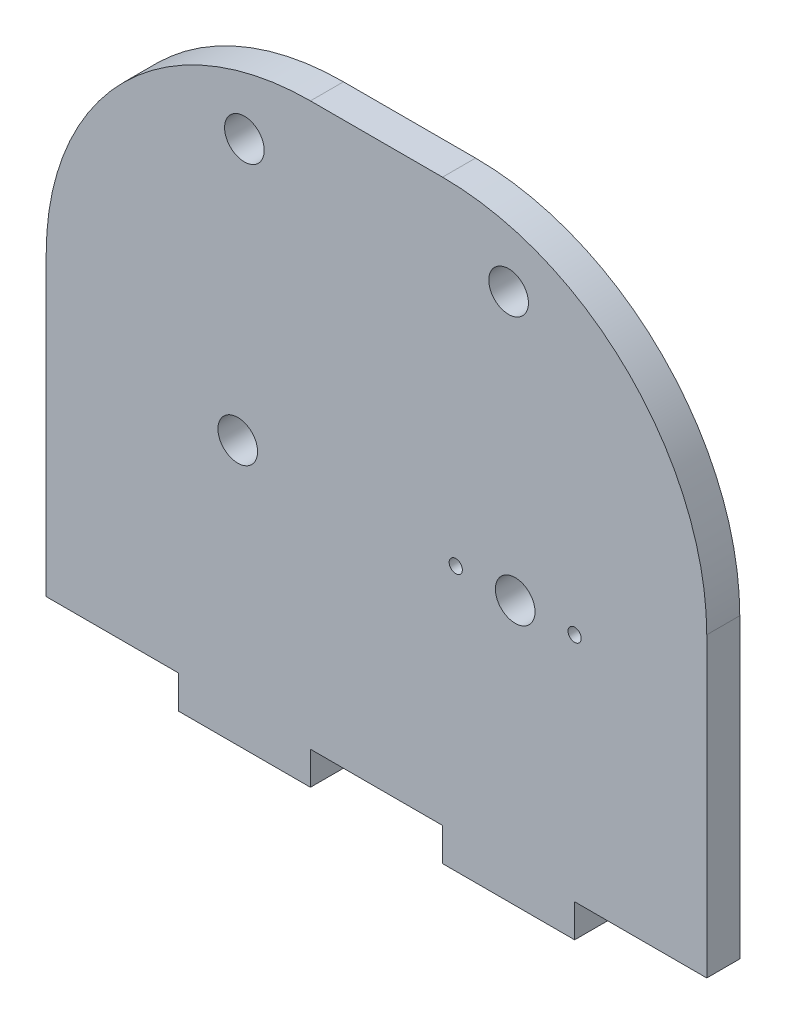
ISO-10303-21;
HEADER;
FILE_DESCRIPTION(('STEP AP214'),'2;1');
FILE_NAME('part.step','',(''),(''),'','','');
FILE_SCHEMA(('AUTOMOTIVE_DESIGN { 1 0 10303 214 1 1 1 1 }'));
ENDSEC;
DATA;
#1=APPLICATION_CONTEXT('core data for automotive mechanical design processes');
#2=APPLICATION_PROTOCOL_DEFINITION('international standard','automotive_design',2000,#1);
#3=PRODUCT_CONTEXT('',#1,'mechanical');
#4=PRODUCT('Part','Part','',(#3));
#5=PRODUCT_RELATED_PRODUCT_CATEGORY('part','',(#4));
#6=PRODUCT_DEFINITION_FORMATION('','',#4);
#7=PRODUCT_DEFINITION_CONTEXT('part definition',#1,'design');
#8=PRODUCT_DEFINITION('design','',#6,#7);
#9=PRODUCT_DEFINITION_SHAPE('','',#8);
#10=(LENGTH_UNIT() NAMED_UNIT(*) SI_UNIT(.MILLI.,.METRE.));
#11=(NAMED_UNIT(*) PLANE_ANGLE_UNIT() SI_UNIT($,.RADIAN.));
#12=(NAMED_UNIT(*) SI_UNIT($,.STERADIAN.) SOLID_ANGLE_UNIT());
#13=UNCERTAINTY_MEASURE_WITH_UNIT(LENGTH_MEASURE(1.E-05),#10,'distance_accuracy_value','');
#14=(GEOMETRIC_REPRESENTATION_CONTEXT(3) GLOBAL_UNCERTAINTY_ASSIGNED_CONTEXT((#13)) GLOBAL_UNIT_ASSIGNED_CONTEXT((#10,
#11,#12)) REPRESENTATION_CONTEXT('',''));
#15=CARTESIAN_POINT('',(0.,0.,0.));
#16=DIRECTION('',(0.,0.,1.));
#17=DIRECTION('',(1.,0.,0.));
#18=AXIS2_PLACEMENT_3D('',#15,#16,#17);
#19=CARTESIAN_POINT('',(5.,-5.,2.5));
#20=DIRECTION('',(0.,0.,1.));
#21=DIRECTION('',(1.,0.,0.));
#22=AXIS2_PLACEMENT_3D('',#19,#20,#21);
#23=PLANE('',#22);
#24=CARTESIAN_POINT('',(15.,-10.,2.5));
#25=DIRECTION('',(0.,0.,1.));
#26=DIRECTION('',(1.,0.,0.));
#27=AXIS2_PLACEMENT_3D('',#24,#25,#26);
#28=CIRCLE('',#27,0.500000000000001);
#29=CARTESIAN_POINT('',(15.5,-10.,2.5));
#30=VERTEX_POINT('',#29);
#31=EDGE_CURVE('E296',#30,#30,#28,.T.);
#32=ORIENTED_EDGE('',*,*,#31,.F.);
#33=EDGE_LOOP('',(#32));
#34=FACE_BOUND('',#33,.T.);
#35=CARTESIAN_POINT('',(-10.5,-10.,2.5));
#36=DIRECTION('',(0.,0.,1.));
#37=DIRECTION('',(1.,0.,0.));
#38=AXIS2_PLACEMENT_3D('',#35,#36,#37);
#39=CIRCLE('',#38,1.5);
#40=CARTESIAN_POINT('',(-9.,-10.,2.5));
#41=VERTEX_POINT('',#40);
#42=EDGE_CURVE('E284',#41,#41,#39,.T.);
#43=ORIENTED_EDGE('',*,*,#42,.F.);
#44=EDGE_LOOP('',(#43));
#45=FACE_BOUND('',#44,.T.);
#46=CARTESIAN_POINT('',(-10.,10.,2.5));
#47=DIRECTION('',(0.,0.,1.));
#48=DIRECTION('',(1.,0.,0.));
#49=AXIS2_PLACEMENT_3D('',#46,#47,#48);
#50=CIRCLE('',#49,1.5);
#51=CARTESIAN_POINT('',(-8.50000000000001,10.,2.5));
#52=VERTEX_POINT('',#51);
#53=EDGE_CURVE('E172',#52,#52,#50,.T.);
#54=ORIENTED_EDGE('',*,*,#53,.F.);
#55=EDGE_LOOP('',(#54));
#56=FACE_BOUND('',#55,.T.);
#57=DIRECTION('',(0.,-1.,0.));
#58=VECTOR('',#57,1.);
#59=CARTESIAN_POINT('',(-25.,-15.,2.5));
#60=LINE('',#59,#58);
#61=CARTESIAN_POINT('',(-25.,-5.00000000000014,2.5));
#62=VERTEX_POINT('',#61);
#63=CARTESIAN_POINT('',(-25.,-27.5,2.5));
#64=VERTEX_POINT('',#63);
#65=EDGE_CURVE('E49',#62,#64,#60,.T.);
#66=ORIENTED_EDGE('',*,*,#65,.T.);
#67=DIRECTION('',(1.,0.,0.));
#68=VECTOR('',#67,1.);
#69=CARTESIAN_POINT('',(-25.,-27.5,2.5));
#70=LINE('',#69,#68);
#71=CARTESIAN_POINT('',(-15.,-27.5,2.5));
#72=VERTEX_POINT('',#71);
#73=EDGE_CURVE('E111',#64,#72,#70,.T.);
#74=ORIENTED_EDGE('',*,*,#73,.T.);
#75=DIRECTION('',(0.,-1.,0.));
#76=VECTOR('',#75,1.);
#77=CARTESIAN_POINT('',(-15.,-27.5,2.5));
#78=LINE('',#77,#76);
#79=CARTESIAN_POINT('',(-15.,-30.,2.5));
#80=VERTEX_POINT('',#79);
#81=EDGE_CURVE('E228',#72,#80,#78,.T.);
#82=ORIENTED_EDGE('',*,*,#81,.T.);
#83=DIRECTION('',(1.,0.,0.));
#84=VECTOR('',#83,1.);
#85=CARTESIAN_POINT('',(-15.,-30.,2.5));
#86=LINE('',#85,#84);
#87=CARTESIAN_POINT('',(-5.,-30.,2.5));
#88=VERTEX_POINT('',#87);
#89=EDGE_CURVE('E248',#80,#88,#86,.T.);
#90=ORIENTED_EDGE('',*,*,#89,.T.);
#91=DIRECTION('',(0.,1.,0.));
#92=VECTOR('',#91,1.);
#93=CARTESIAN_POINT('',(-5.,-30.,2.5));
#94=LINE('',#93,#92);
#95=CARTESIAN_POINT('',(-5.,-27.5,2.5));
#96=VERTEX_POINT('',#95);
#97=EDGE_CURVE('E245',#88,#96,#94,.T.);
#98=ORIENTED_EDGE('',*,*,#97,.T.);
#99=DIRECTION('',(1.,0.,0.));
#100=VECTOR('',#99,1.);
#101=CARTESIAN_POINT('',(-5.,-27.5,2.5));
#102=LINE('',#101,#100);
#103=CARTESIAN_POINT('',(5.,-27.5,2.5));
#104=VERTEX_POINT('',#103);
#105=EDGE_CURVE('E247',#96,#104,#102,.T.);
#106=ORIENTED_EDGE('',*,*,#105,.T.);
#107=DIRECTION('',(0.,-1.,0.));
#108=VECTOR('',#107,1.);
#109=CARTESIAN_POINT('',(5.,-27.5,2.5));
#110=LINE('',#109,#108);
#111=CARTESIAN_POINT('',(5.,-30.,2.5));
#112=VERTEX_POINT('',#111);
#113=EDGE_CURVE('E250',#104,#112,#110,.T.);
#114=ORIENTED_EDGE('',*,*,#113,.T.);
#115=DIRECTION('',(1.,0.,0.));
#116=VECTOR('',#115,1.);
#117=CARTESIAN_POINT('',(5.,-30.,2.5));
#118=LINE('',#117,#116);
#119=CARTESIAN_POINT('',(15.,-30.,2.5));
#120=VERTEX_POINT('',#119);
#121=EDGE_CURVE('E256',#112,#120,#118,.T.);
#122=ORIENTED_EDGE('',*,*,#121,.T.);
#123=DIRECTION('',(0.,1.,0.));
#124=VECTOR('',#123,1.);
#125=CARTESIAN_POINT('',(15.,-30.,2.5));
#126=LINE('',#125,#124);
#127=CARTESIAN_POINT('',(15.,-27.5,2.5));
#128=VERTEX_POINT('',#127);
#129=EDGE_CURVE('E258',#120,#128,#126,.T.);
#130=ORIENTED_EDGE('',*,*,#129,.T.);
#131=DIRECTION('',(1.,0.,0.));
#132=VECTOR('',#131,1.);
#133=CARTESIAN_POINT('',(15.,-27.5,2.5));
#134=LINE('',#133,#132);
#135=CARTESIAN_POINT('',(25.,-27.5,2.5));
#136=VERTEX_POINT('',#135);
#137=EDGE_CURVE('E260',#128,#136,#134,.T.);
#138=ORIENTED_EDGE('',*,*,#137,.T.);
#139=DIRECTION('',(0.,1.,0.));
#140=VECTOR('',#139,1.);
#141=CARTESIAN_POINT('',(25.,-15.,2.5));
#142=LINE('',#141,#140);
#143=CARTESIAN_POINT('',(25.,-5.00000000000014,2.5));
#144=VERTEX_POINT('',#143);
#145=EDGE_CURVE('E149',#136,#144,#142,.T.);
#146=ORIENTED_EDGE('',*,*,#145,.T.);
#147=CARTESIAN_POINT('',(5.,-5.,2.5));
#148=DIRECTION('',(0.,0.,1.));
#149=DIRECTION('',(1.,0.,0.));
#150=AXIS2_PLACEMENT_3D('',#147,#148,#149);
#151=CIRCLE('',#150,20.);
#152=CARTESIAN_POINT('',(4.99999999999986,15.,2.5));
#153=VERTEX_POINT('',#152);
#154=EDGE_CURVE('E143',#144,#153,#151,.T.);
#155=ORIENTED_EDGE('',*,*,#154,.T.);
#156=DIRECTION('',(-1.,0.,0.));
#157=VECTOR('',#156,1.);
#158=CARTESIAN_POINT('',(-4.99999999999986,15.,2.5));
#159=LINE('',#158,#157);
#160=CARTESIAN_POINT('',(-4.99999999999986,15.,2.5));
#161=VERTEX_POINT('',#160);
#162=EDGE_CURVE('E147',#153,#161,#159,.T.);
#163=ORIENTED_EDGE('',*,*,#162,.T.);
#164=CARTESIAN_POINT('',(-5.,-5.,2.5));
#165=DIRECTION('',(0.,0.,1.));
#166=DIRECTION('',(-1.,0.,0.));
#167=AXIS2_PLACEMENT_3D('',#164,#165,#166);
#168=CIRCLE('',#167,20.);
#169=EDGE_CURVE('E163',#161,#62,#168,.T.);
#170=ORIENTED_EDGE('',*,*,#169,.T.);
#171=EDGE_LOOP('',(#66,#74,#82,#90,#98,#106,#114,#122,#130,#138,#146,#155,#163,#170));
#172=FACE_BOUND('',#171,.T.);
#173=CARTESIAN_POINT('',(9.99999999999999,10.,2.5));
#174=DIRECTION('',(0.,0.,1.));
#175=DIRECTION('',(1.,0.,0.));
#176=AXIS2_PLACEMENT_3D('',#173,#174,#175);
#177=CIRCLE('',#176,1.5);
#178=CARTESIAN_POINT('',(11.5,10.,2.5));
#179=VERTEX_POINT('',#178);
#180=EDGE_CURVE('E278',#179,#179,#177,.T.);
#181=ORIENTED_EDGE('',*,*,#180,.F.);
#182=EDGE_LOOP('',(#181));
#183=FACE_BOUND('',#182,.T.);
#184=CARTESIAN_POINT('',(10.5,-10.,2.5));
#185=DIRECTION('',(0.,0.,1.));
#186=DIRECTION('',(1.,0.,0.));
#187=AXIS2_PLACEMENT_3D('',#184,#185,#186);
#188=CIRCLE('',#187,1.5);
#189=CARTESIAN_POINT('',(12.,-10.,2.5));
#190=VERTEX_POINT('',#189);
#191=EDGE_CURVE('E290',#190,#190,#188,.T.);
#192=ORIENTED_EDGE('',*,*,#191,.F.);
#193=EDGE_LOOP('',(#192));
#194=FACE_BOUND('',#193,.T.);
#195=CARTESIAN_POINT('',(6.,-10.,2.5));
#196=DIRECTION('',(0.,0.,1.));
#197=DIRECTION('',(1.,0.,0.));
#198=AXIS2_PLACEMENT_3D('',#195,#196,#197);
#199=CIRCLE('',#198,0.5);
#200=CARTESIAN_POINT('',(6.5,-10.,2.5));
#201=VERTEX_POINT('',#200);
#202=EDGE_CURVE('E302',#201,#201,#199,.T.);
#203=ORIENTED_EDGE('',*,*,#202,.F.);
#204=EDGE_LOOP('',(#203));
#205=FACE_BOUND('',#204,.T.);
#206=ADVANCED_FACE('F32',(#34,#45,#56,#172,#183,#194,#205),#23,.T.);
#207=CARTESIAN_POINT('',(5.,-5.,0.));
#208=DIRECTION('',(0.,0.,1.));
#209=DIRECTION('',(1.,0.,0.));
#210=AXIS2_PLACEMENT_3D('',#207,#208,#209);
#211=PLANE('',#210);
#212=CARTESIAN_POINT('',(15.,-10.,0.));
#213=DIRECTION('',(0.,0.,1.));
#214=DIRECTION('',(1.,0.,0.));
#215=AXIS2_PLACEMENT_3D('',#212,#213,#214);
#216=CIRCLE('',#215,0.500000000000001);
#217=CARTESIAN_POINT('',(15.5,-10.,0.));
#218=VERTEX_POINT('',#217);
#219=EDGE_CURVE('E299',#218,#218,#216,.T.);
#220=ORIENTED_EDGE('',*,*,#219,.T.);
#221=EDGE_LOOP('',(#220));
#222=FACE_BOUND('',#221,.T.);
#223=CARTESIAN_POINT('',(-10.5,-10.,0.));
#224=DIRECTION('',(0.,0.,1.));
#225=DIRECTION('',(1.,0.,0.));
#226=AXIS2_PLACEMENT_3D('',#223,#224,#225);
#227=CIRCLE('',#226,1.5);
#228=CARTESIAN_POINT('',(-9.,-10.,0.));
#229=VERTEX_POINT('',#228);
#230=EDGE_CURVE('E287',#229,#229,#227,.T.);
#231=ORIENTED_EDGE('',*,*,#230,.T.);
#232=EDGE_LOOP('',(#231));
#233=FACE_BOUND('',#232,.T.);
#234=CARTESIAN_POINT('',(-10.,10.,0.));
#235=DIRECTION('',(0.,0.,1.));
#236=DIRECTION('',(1.,0.,0.));
#237=AXIS2_PLACEMENT_3D('',#234,#235,#236);
#238=CIRCLE('',#237,1.5);
#239=CARTESIAN_POINT('',(-8.50000000000001,10.,0.));
#240=VERTEX_POINT('',#239);
#241=EDGE_CURVE('E275',#240,#240,#238,.T.);
#242=ORIENTED_EDGE('',*,*,#241,.T.);
#243=EDGE_LOOP('',(#242));
#244=FACE_BOUND('',#243,.T.);
#245=DIRECTION('',(1.,0.,0.));
#246=VECTOR('',#245,1.);
#247=CARTESIAN_POINT('',(-25.,-27.5,0.));
#248=LINE('',#247,#246);
#249=CARTESIAN_POINT('',(-25.,-27.5,0.));
#250=VERTEX_POINT('',#249);
#251=CARTESIAN_POINT('',(-15.,-27.5,0.));
#252=VERTEX_POINT('',#251);
#253=EDGE_CURVE('E169',#250,#252,#248,.T.);
#254=ORIENTED_EDGE('',*,*,#253,.F.);
#255=DIRECTION('',(0.,-1.,0.));
#256=VECTOR('',#255,1.);
#257=CARTESIAN_POINT('',(-25.,-15.,0.));
#258=LINE('',#257,#256);
#259=CARTESIAN_POINT('',(-25.,-5.00000000000014,0.));
#260=VERTEX_POINT('',#259);
#261=EDGE_CURVE('E194',#260,#250,#258,.T.);
#262=ORIENTED_EDGE('',*,*,#261,.F.);
#263=CARTESIAN_POINT('',(-5.,-5.,0.));
#264=DIRECTION('',(0.,0.,1.));
#265=DIRECTION('',(-1.,0.,0.));
#266=AXIS2_PLACEMENT_3D('',#263,#264,#265);
#267=CIRCLE('',#266,20.);
#268=CARTESIAN_POINT('',(-4.99999999999986,15.,0.));
#269=VERTEX_POINT('',#268);
#270=EDGE_CURVE('E104',#269,#260,#267,.T.);
#271=ORIENTED_EDGE('',*,*,#270,.F.);
#272=DIRECTION('',(-1.,0.,0.));
#273=VECTOR('',#272,1.);
#274=CARTESIAN_POINT('',(-4.99999999999986,15.,0.));
#275=LINE('',#274,#273);
#276=CARTESIAN_POINT('',(4.99999999999986,15.,0.));
#277=VERTEX_POINT('',#276);
#278=EDGE_CURVE('E97',#277,#269,#275,.T.);
#279=ORIENTED_EDGE('',*,*,#278,.F.);
#280=CARTESIAN_POINT('',(5.,-5.,0.));
#281=DIRECTION('',(0.,0.,1.));
#282=DIRECTION('',(1.,0.,0.));
#283=AXIS2_PLACEMENT_3D('',#280,#281,#282);
#284=CIRCLE('',#283,20.);
#285=CARTESIAN_POINT('',(25.,-5.00000000000014,0.));
#286=VERTEX_POINT('',#285);
#287=EDGE_CURVE('E157',#286,#277,#284,.T.);
#288=ORIENTED_EDGE('',*,*,#287,.F.);
#289=DIRECTION('',(0.,1.,0.));
#290=VECTOR('',#289,1.);
#291=CARTESIAN_POINT('',(25.,-15.,0.));
#292=LINE('',#291,#290);
#293=CARTESIAN_POINT('',(25.,-27.5,0.));
#294=VERTEX_POINT('',#293);
#295=EDGE_CURVE('E189',#294,#286,#292,.T.);
#296=ORIENTED_EDGE('',*,*,#295,.F.);
#297=DIRECTION('',(1.,0.,0.));
#298=VECTOR('',#297,1.);
#299=CARTESIAN_POINT('',(15.,-27.5,0.));
#300=LINE('',#299,#298);
#301=CARTESIAN_POINT('',(15.,-27.5,0.));
#302=VERTEX_POINT('',#301);
#303=EDGE_CURVE('E186',#302,#294,#300,.T.);
#304=ORIENTED_EDGE('',*,*,#303,.F.);
#305=DIRECTION('',(0.,1.,0.));
#306=VECTOR('',#305,1.);
#307=CARTESIAN_POINT('',(15.,-30.,0.));
#308=LINE('',#307,#306);
#309=CARTESIAN_POINT('',(15.,-30.,0.));
#310=VERTEX_POINT('',#309);
#311=EDGE_CURVE('E184',#310,#302,#308,.T.);
#312=ORIENTED_EDGE('',*,*,#311,.F.);
#313=DIRECTION('',(1.,0.,0.));
#314=VECTOR('',#313,1.);
#315=CARTESIAN_POINT('',(5.,-30.,0.));
#316=LINE('',#315,#314);
#317=CARTESIAN_POINT('',(5.,-30.,0.));
#318=VERTEX_POINT('',#317);
#319=EDGE_CURVE('E182',#318,#310,#316,.T.);
#320=ORIENTED_EDGE('',*,*,#319,.F.);
#321=DIRECTION('',(0.,-1.,0.));
#322=VECTOR('',#321,1.);
#323=CARTESIAN_POINT('',(5.,-27.5,0.));
#324=LINE('',#323,#322);
#325=CARTESIAN_POINT('',(5.,-27.5,0.));
#326=VERTEX_POINT('',#325);
#327=EDGE_CURVE('E180',#326,#318,#324,.T.);
#328=ORIENTED_EDGE('',*,*,#327,.F.);
#329=DIRECTION('',(1.,0.,0.));
#330=VECTOR('',#329,1.);
#331=CARTESIAN_POINT('',(-5.,-27.5,0.));
#332=LINE('',#331,#330);
#333=CARTESIAN_POINT('',(-5.,-27.5,0.));
#334=VERTEX_POINT('',#333);
#335=EDGE_CURVE('E178',#334,#326,#332,.T.);
#336=ORIENTED_EDGE('',*,*,#335,.F.);
#337=DIRECTION('',(0.,1.,0.));
#338=VECTOR('',#337,1.);
#339=CARTESIAN_POINT('',(-5.,-30.,0.));
#340=LINE('',#339,#338);
#341=CARTESIAN_POINT('',(-5.,-30.,0.));
#342=VERTEX_POINT('',#341);
#343=EDGE_CURVE('E176',#342,#334,#340,.T.);
#344=ORIENTED_EDGE('',*,*,#343,.F.);
#345=DIRECTION('',(1.,0.,0.));
#346=VECTOR('',#345,1.);
#347=CARTESIAN_POINT('',(-15.,-30.,0.));
#348=LINE('',#347,#346);
#349=CARTESIAN_POINT('',(-15.,-30.,0.));
#350=VERTEX_POINT('',#349);
#351=EDGE_CURVE('E174',#350,#342,#348,.T.);
#352=ORIENTED_EDGE('',*,*,#351,.F.);
#353=DIRECTION('',(0.,-1.,0.));
#354=VECTOR('',#353,1.);
#355=CARTESIAN_POINT('',(-15.,-27.5,0.));
#356=LINE('',#355,#354);
#357=EDGE_CURVE('E171',#252,#350,#356,.T.);
#358=ORIENTED_EDGE('',*,*,#357,.F.);
#359=EDGE_LOOP('',(#254,#262,#271,#279,#288,#296,#304,#312,#320,#328,#336,#344,#352,#358));
#360=FACE_BOUND('',#359,.T.);
#361=CARTESIAN_POINT('',(9.99999999999999,10.,0.));
#362=DIRECTION('',(0.,0.,1.));
#363=DIRECTION('',(1.,0.,0.));
#364=AXIS2_PLACEMENT_3D('',#361,#362,#363);
#365=CIRCLE('',#364,1.5);
#366=CARTESIAN_POINT('',(11.5,10.,0.));
#367=VERTEX_POINT('',#366);
#368=EDGE_CURVE('E281',#367,#367,#365,.T.);
#369=ORIENTED_EDGE('',*,*,#368,.T.);
#370=EDGE_LOOP('',(#369));
#371=FACE_BOUND('',#370,.T.);
#372=CARTESIAN_POINT('',(10.5,-10.,0.));
#373=DIRECTION('',(0.,0.,1.));
#374=DIRECTION('',(1.,0.,0.));
#375=AXIS2_PLACEMENT_3D('',#372,#373,#374);
#376=CIRCLE('',#375,1.5);
#377=CARTESIAN_POINT('',(12.,-10.,0.));
#378=VERTEX_POINT('',#377);
#379=EDGE_CURVE('E293',#378,#378,#376,.T.);
#380=ORIENTED_EDGE('',*,*,#379,.T.);
#381=EDGE_LOOP('',(#380));
#382=FACE_BOUND('',#381,.T.);
#383=CARTESIAN_POINT('',(6.,-10.,0.));
#384=DIRECTION('',(0.,0.,1.));
#385=DIRECTION('',(1.,0.,0.));
#386=AXIS2_PLACEMENT_3D('',#383,#384,#385);
#387=CIRCLE('',#386,0.5);
#388=CARTESIAN_POINT('',(6.5,-10.,0.));
#389=VERTEX_POINT('',#388);
#390=EDGE_CURVE('E305',#389,#389,#387,.T.);
#391=ORIENTED_EDGE('',*,*,#390,.T.);
#392=EDGE_LOOP('',(#391));
#393=FACE_BOUND('',#392,.T.);
#394=ADVANCED_FACE('F232',(#222,#233,#244,#360,#371,#382,#393),#211,.F.);
#395=CARTESIAN_POINT('',(-25.,-27.5,2.5));
#396=DIRECTION('',(0.,1.,0.));
#397=DIRECTION('',(0.,0.,1.));
#398=AXIS2_PLACEMENT_3D('',#395,#396,#397);
#399=PLANE('',#398);
#400=ORIENTED_EDGE('',*,*,#253,.T.);
#401=DIRECTION('',(0.,0.,-1.));
#402=VECTOR('',#401,1.);
#403=CARTESIAN_POINT('',(-15.,-27.5,2.5));
#404=LINE('',#403,#402);
#405=EDGE_CURVE('E41',#72,#252,#404,.T.);
#406=ORIENTED_EDGE('',*,*,#405,.F.);
#407=ORIENTED_EDGE('',*,*,#73,.F.);
#408=DIRECTION('',(0.,0.,-1.));
#409=VECTOR('',#408,1.);
#410=CARTESIAN_POINT('',(-25.,-27.5,2.5));
#411=LINE('',#410,#409);
#412=EDGE_CURVE('E11',#64,#250,#411,.T.);
#413=ORIENTED_EDGE('',*,*,#412,.T.);
#414=EDGE_LOOP('',(#400,#406,#407,#413));
#415=FACE_BOUND('',#414,.T.);
#416=ADVANCED_FACE('F34',(#415),#399,.F.);
#417=CARTESIAN_POINT('',(-15.,-27.5,2.5));
#418=DIRECTION('',(1.,0.,0.));
#419=DIRECTION('',(0.,0.,-1.));
#420=AXIS2_PLACEMENT_3D('',#417,#418,#419);
#421=PLANE('',#420);
#422=ORIENTED_EDGE('',*,*,#357,.T.);
#423=DIRECTION('',(0.,0.,-1.));
#424=VECTOR('',#423,1.);
#425=CARTESIAN_POINT('',(-15.,-30.,2.5));
#426=LINE('',#425,#424);
#427=EDGE_CURVE('E220',#80,#350,#426,.T.);
#428=ORIENTED_EDGE('',*,*,#427,.F.);
#429=ORIENTED_EDGE('',*,*,#81,.F.);
#430=ORIENTED_EDGE('',*,*,#405,.T.);
#431=EDGE_LOOP('',(#422,#428,#429,#430));
#432=FACE_BOUND('',#431,.T.);
#433=ADVANCED_FACE('F226',(#432),#421,.F.);
#434=CARTESIAN_POINT('',(-15.,-30.,2.5));
#435=DIRECTION('',(0.,1.,0.));
#436=DIRECTION('',(0.,0.,1.));
#437=AXIS2_PLACEMENT_3D('',#434,#435,#436);
#438=PLANE('',#437);
#439=ORIENTED_EDGE('',*,*,#351,.T.);
#440=DIRECTION('',(0.,0.,-1.));
#441=VECTOR('',#440,1.);
#442=CARTESIAN_POINT('',(-5.,-30.,2.5));
#443=LINE('',#442,#441);
#444=EDGE_CURVE('E217',#88,#342,#443,.T.);
#445=ORIENTED_EDGE('',*,*,#444,.F.);
#446=ORIENTED_EDGE('',*,*,#89,.F.);
#447=ORIENTED_EDGE('',*,*,#427,.T.);
#448=EDGE_LOOP('',(#439,#445,#446,#447));
#449=FACE_BOUND('',#448,.T.);
#450=ADVANCED_FACE('F239',(#449),#438,.F.);
#451=CARTESIAN_POINT('',(-5.,-30.,2.5));
#452=DIRECTION('',(-1.,0.,0.));
#453=DIRECTION('',(0.,0.,1.));
#454=AXIS2_PLACEMENT_3D('',#451,#452,#453);
#455=PLANE('',#454);
#456=ORIENTED_EDGE('',*,*,#343,.T.);
#457=DIRECTION('',(0.,0.,-1.));
#458=VECTOR('',#457,1.);
#459=CARTESIAN_POINT('',(-5.,-27.5,2.5));
#460=LINE('',#459,#458);
#461=EDGE_CURVE('E214',#96,#334,#460,.T.);
#462=ORIENTED_EDGE('',*,*,#461,.F.);
#463=ORIENTED_EDGE('',*,*,#97,.F.);
#464=ORIENTED_EDGE('',*,*,#444,.T.);
#465=EDGE_LOOP('',(#456,#462,#463,#464));
#466=FACE_BOUND('',#465,.T.);
#467=ADVANCED_FACE('F243',(#466),#455,.F.);
#468=CARTESIAN_POINT('',(-5.,-27.5,2.5));
#469=DIRECTION('',(0.,1.,0.));
#470=DIRECTION('',(0.,0.,1.));
#471=AXIS2_PLACEMENT_3D('',#468,#469,#470);
#472=PLANE('',#471);
#473=ORIENTED_EDGE('',*,*,#335,.T.);
#474=DIRECTION('',(0.,0.,-1.));
#475=VECTOR('',#474,1.);
#476=CARTESIAN_POINT('',(5.,-27.5,2.5));
#477=LINE('',#476,#475);
#478=EDGE_CURVE('E211',#104,#326,#477,.T.);
#479=ORIENTED_EDGE('',*,*,#478,.F.);
#480=ORIENTED_EDGE('',*,*,#105,.F.);
#481=ORIENTED_EDGE('',*,*,#461,.T.);
#482=EDGE_LOOP('',(#473,#479,#480,#481));
#483=FACE_BOUND('',#482,.T.);
#484=ADVANCED_FACE('F351',(#483),#472,.F.);
#485=CARTESIAN_POINT('',(5.,-27.5,2.5));
#486=DIRECTION('',(1.,0.,0.));
#487=DIRECTION('',(0.,0.,-1.));
#488=AXIS2_PLACEMENT_3D('',#485,#486,#487);
#489=PLANE('',#488);
#490=ORIENTED_EDGE('',*,*,#327,.T.);
#491=DIRECTION('',(0.,0.,-1.));
#492=VECTOR('',#491,1.);
#493=CARTESIAN_POINT('',(5.,-30.,2.5));
#494=LINE('',#493,#492);
#495=EDGE_CURVE('E208',#112,#318,#494,.T.);
#496=ORIENTED_EDGE('',*,*,#495,.F.);
#497=ORIENTED_EDGE('',*,*,#113,.F.);
#498=ORIENTED_EDGE('',*,*,#478,.T.);
#499=EDGE_LOOP('',(#490,#496,#497,#498));
#500=FACE_BOUND('',#499,.T.);
#501=ADVANCED_FACE('F347',(#500),#489,.F.);
#502=CARTESIAN_POINT('',(5.,-30.,2.5));
#503=DIRECTION('',(0.,1.,0.));
#504=DIRECTION('',(0.,0.,1.));
#505=AXIS2_PLACEMENT_3D('',#502,#503,#504);
#506=PLANE('',#505);
#507=ORIENTED_EDGE('',*,*,#319,.T.);
#508=DIRECTION('',(0.,0.,-1.));
#509=VECTOR('',#508,1.);
#510=CARTESIAN_POINT('',(15.,-30.,2.5));
#511=LINE('',#510,#509);
#512=EDGE_CURVE('E205',#120,#310,#511,.T.);
#513=ORIENTED_EDGE('',*,*,#512,.F.);
#514=ORIENTED_EDGE('',*,*,#121,.F.);
#515=ORIENTED_EDGE('',*,*,#495,.T.);
#516=EDGE_LOOP('',(#507,#513,#514,#515));
#517=FACE_BOUND('',#516,.T.);
#518=ADVANCED_FACE('F343',(#517),#506,.F.);
#519=CARTESIAN_POINT('',(15.,-30.,2.5));
#520=DIRECTION('',(-1.,0.,0.));
#521=DIRECTION('',(0.,0.,1.));
#522=AXIS2_PLACEMENT_3D('',#519,#520,#521);
#523=PLANE('',#522);
#524=ORIENTED_EDGE('',*,*,#311,.T.);
#525=DIRECTION('',(0.,0.,-1.));
#526=VECTOR('',#525,1.);
#527=CARTESIAN_POINT('',(15.,-27.5,2.5));
#528=LINE('',#527,#526);
#529=EDGE_CURVE('E202',#128,#302,#528,.T.);
#530=ORIENTED_EDGE('',*,*,#529,.F.);
#531=ORIENTED_EDGE('',*,*,#129,.F.);
#532=ORIENTED_EDGE('',*,*,#512,.T.);
#533=EDGE_LOOP('',(#524,#530,#531,#532));
#534=FACE_BOUND('',#533,.T.);
#535=ADVANCED_FACE('F340',(#534),#523,.F.);
#536=CARTESIAN_POINT('',(15.,-27.5,2.5));
#537=DIRECTION('',(0.,1.,0.));
#538=DIRECTION('',(0.,0.,1.));
#539=AXIS2_PLACEMENT_3D('',#536,#537,#538);
#540=PLANE('',#539);
#541=ORIENTED_EDGE('',*,*,#303,.T.);
#542=DIRECTION('',(0.,0.,-1.));
#543=VECTOR('',#542,1.);
#544=CARTESIAN_POINT('',(25.,-27.5,2.5));
#545=LINE('',#544,#543);
#546=EDGE_CURVE('E199',#136,#294,#545,.T.);
#547=ORIENTED_EDGE('',*,*,#546,.F.);
#548=ORIENTED_EDGE('',*,*,#137,.F.);
#549=ORIENTED_EDGE('',*,*,#529,.T.);
#550=EDGE_LOOP('',(#541,#547,#548,#549));
#551=FACE_BOUND('',#550,.T.);
#552=ADVANCED_FACE('F266',(#551),#540,.F.);
#553=CARTESIAN_POINT('',(25.,-15.,2.5));
#554=DIRECTION('',(-1.,0.,0.));
#555=DIRECTION('',(0.,0.,1.));
#556=AXIS2_PLACEMENT_3D('',#553,#554,#555);
#557=PLANE('',#556);
#558=ORIENTED_EDGE('',*,*,#295,.T.);
#559=DIRECTION('',(0.,0.,-1.));
#560=VECTOR('',#559,1.);
#561=CARTESIAN_POINT('',(25.,-5.00000000000014,2.5));
#562=LINE('',#561,#560);
#563=EDGE_CURVE('E158',#144,#286,#562,.T.);
#564=ORIENTED_EDGE('',*,*,#563,.F.);
#565=ORIENTED_EDGE('',*,*,#145,.F.);
#566=ORIENTED_EDGE('',*,*,#546,.T.);
#567=EDGE_LOOP('',(#558,#564,#565,#566));
#568=FACE_BOUND('',#567,.T.);
#569=ADVANCED_FACE('F269',(#568),#557,.F.);
#570=CARTESIAN_POINT('',(5.,-5.,2.5));
#571=DIRECTION('',(0.,0.,-1.));
#572=DIRECTION('',(-1.,0.,0.));
#573=AXIS2_PLACEMENT_3D('',#570,#571,#572);
#574=CYLINDRICAL_SURFACE('',#573,20.);
#575=ORIENTED_EDGE('',*,*,#287,.T.);
#576=DIRECTION('',(0.,0.,-1.));
#577=VECTOR('',#576,1.);
#578=CARTESIAN_POINT('',(4.99999999999986,15.,2.5));
#579=LINE('',#578,#577);
#580=EDGE_CURVE('E154',#153,#277,#579,.T.);
#581=ORIENTED_EDGE('',*,*,#580,.F.);
#582=ORIENTED_EDGE('',*,*,#154,.F.);
#583=ORIENTED_EDGE('',*,*,#563,.T.);
#584=EDGE_LOOP('',(#575,#581,#582,#583));
#585=FACE_BOUND('',#584,.T.);
#586=ADVANCED_FACE('F155',(#585),#574,.T.);
#587=CARTESIAN_POINT('',(-4.99999999999986,15.,2.5));
#588=DIRECTION('',(0.,-1.,0.));
#589=DIRECTION('',(0.,0.,-1.));
#590=AXIS2_PLACEMENT_3D('',#587,#588,#589);
#591=PLANE('',#590);
#592=ORIENTED_EDGE('',*,*,#278,.T.);
#593=DIRECTION('',(0.,0.,-1.));
#594=VECTOR('',#593,1.);
#595=CARTESIAN_POINT('',(-4.99999999999986,15.,2.5));
#596=LINE('',#595,#594);
#597=EDGE_CURVE('E159',#161,#269,#596,.T.);
#598=ORIENTED_EDGE('',*,*,#597,.F.);
#599=ORIENTED_EDGE('',*,*,#162,.F.);
#600=ORIENTED_EDGE('',*,*,#580,.T.);
#601=EDGE_LOOP('',(#592,#598,#599,#600));
#602=FACE_BOUND('',#601,.T.);
#603=ADVANCED_FACE('F161',(#602),#591,.F.);
#604=CARTESIAN_POINT('',(-5.,-5.,2.5));
#605=DIRECTION('',(0.,0.,-1.));
#606=DIRECTION('',(-1.,0.,0.));
#607=AXIS2_PLACEMENT_3D('',#604,#605,#606);
#608=CYLINDRICAL_SURFACE('',#607,20.);
#609=ORIENTED_EDGE('',*,*,#270,.T.);
#610=DIRECTION('',(0.,0.,-1.));
#611=VECTOR('',#610,1.);
#612=CARTESIAN_POINT('',(-25.,-5.00000000000014,2.5));
#613=LINE('',#612,#611);
#614=EDGE_CURVE('E165',#62,#260,#613,.T.);
#615=ORIENTED_EDGE('',*,*,#614,.F.);
#616=ORIENTED_EDGE('',*,*,#169,.F.);
#617=ORIENTED_EDGE('',*,*,#597,.T.);
#618=EDGE_LOOP('',(#609,#615,#616,#617));
#619=FACE_BOUND('',#618,.T.);
#620=ADVANCED_FACE('F271',(#619),#608,.T.);
#621=CARTESIAN_POINT('',(-25.,-15.,2.5));
#622=DIRECTION('',(1.,0.,0.));
#623=DIRECTION('',(0.,0.,-1.));
#624=AXIS2_PLACEMENT_3D('',#621,#622,#623);
#625=PLANE('',#624);
#626=ORIENTED_EDGE('',*,*,#261,.T.);
#627=ORIENTED_EDGE('',*,*,#412,.F.);
#628=ORIENTED_EDGE('',*,*,#65,.F.);
#629=ORIENTED_EDGE('',*,*,#614,.T.);
#630=EDGE_LOOP('',(#626,#627,#628,#629));
#631=FACE_BOUND('',#630,.T.);
#632=ADVANCED_FACE('F270',(#631),#625,.F.);
#633=CARTESIAN_POINT('',(-10.,10.,2.5));
#634=DIRECTION('',(0.,0.,-1.));
#635=DIRECTION('',(-1.,0.,0.));
#636=AXIS2_PLACEMENT_3D('',#633,#634,#635);
#637=CYLINDRICAL_SURFACE('',#636,1.5);
#638=ORIENTED_EDGE('',*,*,#53,.T.);
#639=EDGE_LOOP('',(#638));
#640=FACE_BOUND('',#639,.T.);
#641=ORIENTED_EDGE('',*,*,#241,.F.);
#642=EDGE_LOOP('',(#641));
#643=FACE_BOUND('',#642,.T.);
#644=ADVANCED_FACE('F325',(#640,#643),#637,.F.);
#645=CARTESIAN_POINT('',(9.99999999999999,10.,2.5));
#646=DIRECTION('',(0.,0.,-1.));
#647=DIRECTION('',(-1.,0.,0.));
#648=AXIS2_PLACEMENT_3D('',#645,#646,#647);
#649=CYLINDRICAL_SURFACE('',#648,1.5);
#650=ORIENTED_EDGE('',*,*,#180,.T.);
#651=EDGE_LOOP('',(#650));
#652=FACE_BOUND('',#651,.T.);
#653=ORIENTED_EDGE('',*,*,#368,.F.);
#654=EDGE_LOOP('',(#653));
#655=FACE_BOUND('',#654,.T.);
#656=ADVANCED_FACE('F455',(#652,#655),#649,.F.);
#657=CARTESIAN_POINT('',(-10.5,-10.,2.5));
#658=DIRECTION('',(0.,0.,-1.));
#659=DIRECTION('',(-1.,0.,0.));
#660=AXIS2_PLACEMENT_3D('',#657,#658,#659);
#661=CYLINDRICAL_SURFACE('',#660,1.5);
#662=ORIENTED_EDGE('',*,*,#42,.T.);
#663=EDGE_LOOP('',(#662));
#664=FACE_BOUND('',#663,.T.);
#665=ORIENTED_EDGE('',*,*,#230,.F.);
#666=EDGE_LOOP('',(#665));
#667=FACE_BOUND('',#666,.T.);
#668=ADVANCED_FACE('F463',(#664,#667),#661,.F.);
#669=CARTESIAN_POINT('',(10.5,-10.,2.5));
#670=DIRECTION('',(0.,0.,-1.));
#671=DIRECTION('',(-1.,0.,0.));
#672=AXIS2_PLACEMENT_3D('',#669,#670,#671);
#673=CYLINDRICAL_SURFACE('',#672,1.5);
#674=ORIENTED_EDGE('',*,*,#191,.T.);
#675=EDGE_LOOP('',(#674));
#676=FACE_BOUND('',#675,.T.);
#677=ORIENTED_EDGE('',*,*,#379,.F.);
#678=EDGE_LOOP('',(#677));
#679=FACE_BOUND('',#678,.T.);
#680=ADVANCED_FACE('F471',(#676,#679),#673,.F.);
#681=CARTESIAN_POINT('',(15.,-10.,2.5));
#682=DIRECTION('',(0.,0.,-1.));
#683=DIRECTION('',(-1.,0.,0.));
#684=AXIS2_PLACEMENT_3D('',#681,#682,#683);
#685=CYLINDRICAL_SURFACE('',#684,0.500000000000001);
#686=ORIENTED_EDGE('',*,*,#31,.T.);
#687=EDGE_LOOP('',(#686));
#688=FACE_BOUND('',#687,.T.);
#689=ORIENTED_EDGE('',*,*,#219,.F.);
#690=EDGE_LOOP('',(#689));
#691=FACE_BOUND('',#690,.T.);
#692=ADVANCED_FACE('F480',(#688,#691),#685,.F.);
#693=CARTESIAN_POINT('',(6.,-10.,2.5));
#694=DIRECTION('',(0.,0.,-1.));
#695=DIRECTION('',(-1.,0.,0.));
#696=AXIS2_PLACEMENT_3D('',#693,#694,#695);
#697=CYLINDRICAL_SURFACE('',#696,0.5);
#698=ORIENTED_EDGE('',*,*,#202,.T.);
#699=EDGE_LOOP('',(#698));
#700=FACE_BOUND('',#699,.T.);
#701=ORIENTED_EDGE('',*,*,#390,.F.);
#702=EDGE_LOOP('',(#701));
#703=FACE_BOUND('',#702,.T.);
#704=ADVANCED_FACE('F311',(#700,#703),#697,.F.);
#705=CLOSED_SHELL('',(#206,#394,#416,#433,#450,#467,#484,#501,#518,#535,#552,#569,#586,#603,
#620,#632,#644,#656,#668,#680,#692,#704));
#706=MANIFOLD_SOLID_BREP('B2',#705);
#707=ADVANCED_BREP_SHAPE_REPRESENTATION('',(#18,#706),#14);
#708=SHAPE_DEFINITION_REPRESENTATION(#9,#707);
ENDSEC;
END-ISO-10303-21;
